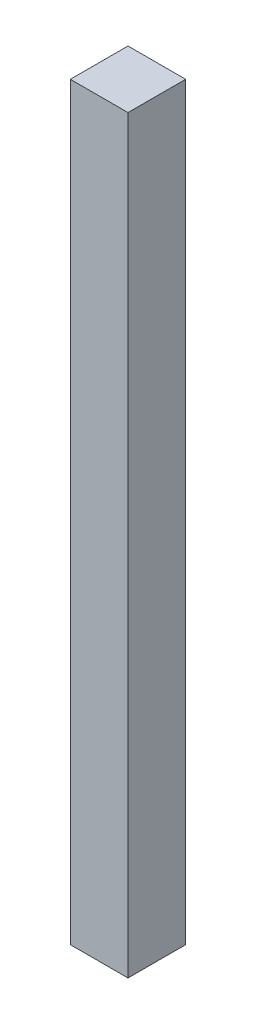
ISO-10303-21;
HEADER;
FILE_DESCRIPTION(('STEP AP214'),'2;1');
FILE_NAME('part.step','',(''),(''),'','','');
FILE_SCHEMA(('AUTOMOTIVE_DESIGN { 1 0 10303 214 1 1 1 1 }'));
ENDSEC;
DATA;
#1=APPLICATION_CONTEXT('core data for automotive mechanical design processes');
#2=APPLICATION_PROTOCOL_DEFINITION('international standard','automotive_design',2000,#1);
#3=PRODUCT_CONTEXT('',#1,'mechanical');
#4=PRODUCT('Part','Part','',(#3));
#5=PRODUCT_RELATED_PRODUCT_CATEGORY('part','',(#4));
#6=PRODUCT_DEFINITION_FORMATION('','',#4);
#7=PRODUCT_DEFINITION_CONTEXT('part definition',#1,'design');
#8=PRODUCT_DEFINITION('design','',#6,#7);
#9=PRODUCT_DEFINITION_SHAPE('','',#8);
#10=(LENGTH_UNIT() NAMED_UNIT(*) SI_UNIT(.MILLI.,.METRE.));
#11=(NAMED_UNIT(*) PLANE_ANGLE_UNIT() SI_UNIT($,.RADIAN.));
#12=(NAMED_UNIT(*) SI_UNIT($,.STERADIAN.) SOLID_ANGLE_UNIT());
#13=UNCERTAINTY_MEASURE_WITH_UNIT(LENGTH_MEASURE(1.E-05),#10,'distance_accuracy_value','');
#14=(GEOMETRIC_REPRESENTATION_CONTEXT(3) GLOBAL_UNCERTAINTY_ASSIGNED_CONTEXT((#13)) GLOBAL_UNIT_ASSIGNED_CONTEXT((#10,
#11,#12)) REPRESENTATION_CONTEXT('',''));
#15=CARTESIAN_POINT('',(0.,0.,0.));
#16=DIRECTION('',(0.,0.,1.));
#17=DIRECTION('',(1.,0.,0.));
#18=AXIS2_PLACEMENT_3D('',#15,#16,#17);
#19=CARTESIAN_POINT('',(19.05,495.3,-19.05));
#20=DIRECTION('',(-1.,0.,0.));
#21=DIRECTION('',(0.,0.,1.));
#22=AXIS2_PLACEMENT_3D('',#19,#20,#21);
#23=PLANE('',#22);
#24=DIRECTION('',(0.,0.,-1.));
#25=VECTOR('',#24,1.);
#26=CARTESIAN_POINT('',(19.05,0.,-19.05));
#27=LINE('',#26,#25);
#28=CARTESIAN_POINT('',(19.05,0.,19.05));
#29=VERTEX_POINT('',#28);
#30=CARTESIAN_POINT('',(19.05,0.,-19.05));
#31=VERTEX_POINT('',#30);
#32=EDGE_CURVE('E100',#29,#31,#27,.T.);
#33=ORIENTED_EDGE('',*,*,#32,.T.);
#34=DIRECTION('',(0.,-1.,0.));
#35=VECTOR('',#34,1.);
#36=CARTESIAN_POINT('',(19.05,495.3,-19.05));
#37=LINE('',#36,#35);
#38=CARTESIAN_POINT('',(19.05,495.3,-19.05));
#39=VERTEX_POINT('',#38);
#40=EDGE_CURVE('E37',#39,#31,#37,.T.);
#41=ORIENTED_EDGE('',*,*,#40,.F.);
#42=DIRECTION('',(0.,0.,-1.));
#43=VECTOR('',#42,1.);
#44=CARTESIAN_POINT('',(19.05,495.3,-19.05));
#45=LINE('',#44,#43);
#46=CARTESIAN_POINT('',(19.05,495.3,19.05));
#47=VERTEX_POINT('',#46);
#48=EDGE_CURVE('E87',#47,#39,#45,.T.);
#49=ORIENTED_EDGE('',*,*,#48,.F.);
#50=DIRECTION('',(0.,-1.,0.));
#51=VECTOR('',#50,1.);
#52=CARTESIAN_POINT('',(19.05,495.3,19.05));
#53=LINE('',#52,#51);
#54=EDGE_CURVE('E96',#47,#29,#53,.T.);
#55=ORIENTED_EDGE('',*,*,#54,.T.);
#56=EDGE_LOOP('',(#33,#41,#49,#55));
#57=FACE_BOUND('',#56,.T.);
#58=ADVANCED_FACE('F34',(#57),#23,.F.);
#59=CARTESIAN_POINT('',(-19.05,495.3,-19.05));
#60=DIRECTION('',(0.,0.,1.));
#61=DIRECTION('',(1.,0.,0.));
#62=AXIS2_PLACEMENT_3D('',#59,#60,#61);
#63=PLANE('',#62);
#64=DIRECTION('',(-1.,0.,0.));
#65=VECTOR('',#64,1.);
#66=CARTESIAN_POINT('',(-19.05,0.,-19.05));
#67=LINE('',#66,#65);
#68=CARTESIAN_POINT('',(-19.05,0.,-19.05));
#69=VERTEX_POINT('',#68);
#70=EDGE_CURVE('E92',#31,#69,#67,.T.);
#71=ORIENTED_EDGE('',*,*,#70,.T.);
#72=DIRECTION('',(0.,-1.,0.));
#73=VECTOR('',#72,1.);
#74=CARTESIAN_POINT('',(-19.05,495.3,-19.05));
#75=LINE('',#74,#73);
#76=CARTESIAN_POINT('',(-19.05,495.3,-19.05));
#77=VERTEX_POINT('',#76);
#78=EDGE_CURVE('E90',#77,#69,#75,.T.);
#79=ORIENTED_EDGE('',*,*,#78,.F.);
#80=DIRECTION('',(-1.,0.,0.));
#81=VECTOR('',#80,1.);
#82=CARTESIAN_POINT('',(-19.05,495.3,-19.05));
#83=LINE('',#82,#81);
#84=EDGE_CURVE('E82',#39,#77,#83,.T.);
#85=ORIENTED_EDGE('',*,*,#84,.F.);
#86=ORIENTED_EDGE('',*,*,#40,.T.);
#87=EDGE_LOOP('',(#71,#79,#85,#86));
#88=FACE_BOUND('',#87,.T.);
#89=ADVANCED_FACE('F91',(#88),#63,.F.);
#90=CARTESIAN_POINT('',(-19.05,495.3,-19.05));
#91=DIRECTION('',(1.,0.,0.));
#92=DIRECTION('',(0.,0.,-1.));
#93=AXIS2_PLACEMENT_3D('',#90,#91,#92);
#94=PLANE('',#93);
#95=DIRECTION('',(0.,0.,1.));
#96=VECTOR('',#95,1.);
#97=CARTESIAN_POINT('',(-19.05,0.,-19.05));
#98=LINE('',#97,#96);
#99=CARTESIAN_POINT('',(-19.05,0.,19.05));
#100=VERTEX_POINT('',#99);
#101=EDGE_CURVE('E68',#69,#100,#98,.T.);
#102=ORIENTED_EDGE('',*,*,#101,.T.);
#103=DIRECTION('',(0.,-1.,0.));
#104=VECTOR('',#103,1.);
#105=CARTESIAN_POINT('',(-19.05,495.3,19.05));
#106=LINE('',#105,#104);
#107=CARTESIAN_POINT('',(-19.05,495.3,19.05));
#108=VERTEX_POINT('',#107);
#109=EDGE_CURVE('E93',#108,#100,#106,.T.);
#110=ORIENTED_EDGE('',*,*,#109,.F.);
#111=DIRECTION('',(0.,0.,1.));
#112=VECTOR('',#111,1.);
#113=CARTESIAN_POINT('',(-19.05,495.3,-19.05));
#114=LINE('',#113,#112);
#115=EDGE_CURVE('E85',#77,#108,#114,.T.);
#116=ORIENTED_EDGE('',*,*,#115,.F.);
#117=ORIENTED_EDGE('',*,*,#78,.T.);
#118=EDGE_LOOP('',(#102,#110,#116,#117));
#119=FACE_BOUND('',#118,.T.);
#120=ADVANCED_FACE('F94',(#119),#94,.F.);
#121=CARTESIAN_POINT('',(-19.05,495.3,19.05));
#122=DIRECTION('',(0.,0.,-1.));
#123=DIRECTION('',(-1.,0.,0.));
#124=AXIS2_PLACEMENT_3D('',#121,#122,#123);
#125=PLANE('',#124);
#126=DIRECTION('',(1.,0.,0.));
#127=VECTOR('',#126,1.);
#128=CARTESIAN_POINT('',(-19.05,0.,19.05));
#129=LINE('',#128,#127);
#130=EDGE_CURVE('E74',#100,#29,#129,.T.);
#131=ORIENTED_EDGE('',*,*,#130,.T.);
#132=ORIENTED_EDGE('',*,*,#54,.F.);
#133=DIRECTION('',(1.,0.,0.));
#134=VECTOR('',#133,1.);
#135=CARTESIAN_POINT('',(-19.05,495.3,19.05));
#136=LINE('',#135,#134);
#137=EDGE_CURVE('E51',#108,#47,#136,.T.);
#138=ORIENTED_EDGE('',*,*,#137,.F.);
#139=ORIENTED_EDGE('',*,*,#109,.T.);
#140=EDGE_LOOP('',(#131,#132,#138,#139));
#141=FACE_BOUND('',#140,.T.);
#142=ADVANCED_FACE('F108',(#141),#125,.F.);
#143=CARTESIAN_POINT('',(0.,495.3,0.));
#144=DIRECTION('',(0.,1.,0.));
#145=DIRECTION('',(0.,0.,1.));
#146=AXIS2_PLACEMENT_3D('',#143,#144,#145);
#147=PLANE('',#146);
#148=ORIENTED_EDGE('',*,*,#48,.T.);
#149=ORIENTED_EDGE('',*,*,#84,.T.);
#150=ORIENTED_EDGE('',*,*,#115,.T.);
#151=ORIENTED_EDGE('',*,*,#137,.T.);
#152=EDGE_LOOP('',(#148,#149,#150,#151));
#153=FACE_BOUND('',#152,.T.);
#154=ADVANCED_FACE('F83',(#153),#147,.T.);
#155=CARTESIAN_POINT('',(0.,0.,0.));
#156=DIRECTION('',(0.,1.,0.));
#157=DIRECTION('',(0.,0.,1.));
#158=AXIS2_PLACEMENT_3D('',#155,#156,#157);
#159=PLANE('',#158);
#160=CARTESIAN_POINT('',(0.,0.,0.));
#161=DIRECTION('',(0.,-1.,0.));
#162=DIRECTION('',(0.,0.,-1.));
#163=AXIS2_PLACEMENT_3D('',#160,#161,#162);
#164=CIRCLE('',#163,6.35);
#165=CARTESIAN_POINT('',(0.,0.,-6.35));
#166=VERTEX_POINT('',#165);
#167=EDGE_CURVE('E11',#166,#166,#164,.T.);
#168=ORIENTED_EDGE('',*,*,#167,.F.);
#169=EDGE_LOOP('',(#168));
#170=FACE_BOUND('',#169,.T.);
#171=ORIENTED_EDGE('',*,*,#32,.F.);
#172=ORIENTED_EDGE('',*,*,#130,.F.);
#173=ORIENTED_EDGE('',*,*,#101,.F.);
#174=ORIENTED_EDGE('',*,*,#70,.F.);
#175=EDGE_LOOP('',(#171,#172,#173,#174));
#176=FACE_BOUND('',#175,.T.);
#177=ADVANCED_FACE('F111',(#170,#176),#159,.F.);
#178=CARTESIAN_POINT('',(0.,-12.7,0.));
#179=DIRECTION('',(0.,1.,0.));
#180=DIRECTION('',(0.,0.,1.));
#181=AXIS2_PLACEMENT_3D('',#178,#179,#180);
#182=CYLINDRICAL_SURFACE('',#181,6.35);
#183=CARTESIAN_POINT('',(0.,-12.7,0.));
#184=DIRECTION('',(0.,-1.,0.));
#185=DIRECTION('',(0.,0.,-1.));
#186=AXIS2_PLACEMENT_3D('',#183,#184,#185);
#187=CIRCLE('',#186,6.35);
#188=CARTESIAN_POINT('',(0.,-12.7,-6.35));
#189=VERTEX_POINT('',#188);
#190=EDGE_CURVE('E103',#189,#189,#187,.T.);
#191=ORIENTED_EDGE('',*,*,#190,.F.);
#192=EDGE_LOOP('',(#191));
#193=FACE_BOUND('',#192,.T.);
#194=ORIENTED_EDGE('',*,*,#167,.T.);
#195=EDGE_LOOP('',(#194));
#196=FACE_BOUND('',#195,.T.);
#197=ADVANCED_FACE('F119',(#193,#196),#182,.T.);
#198=CARTESIAN_POINT('',(0.,-12.7,0.));
#199=DIRECTION('',(0.,-1.,0.));
#200=DIRECTION('',(0.,0.,-1.));
#201=AXIS2_PLACEMENT_3D('',#198,#199,#200);
#202=PLANE('',#201);
#203=ORIENTED_EDGE('',*,*,#190,.T.);
#204=EDGE_LOOP('',(#203));
#205=FACE_BOUND('',#204,.T.);
#206=ADVANCED_FACE('F117',(#205),#202,.T.);
#207=CLOSED_SHELL('',(#58,#89,#120,#142,#154,#177,#197,#206));
#208=MANIFOLD_SOLID_BREP('B2',#207);
#209=ADVANCED_BREP_SHAPE_REPRESENTATION('',(#18,#208),#14);
#210=SHAPE_DEFINITION_REPRESENTATION(#9,#209);
ENDSEC;
END-ISO-10303-21;
